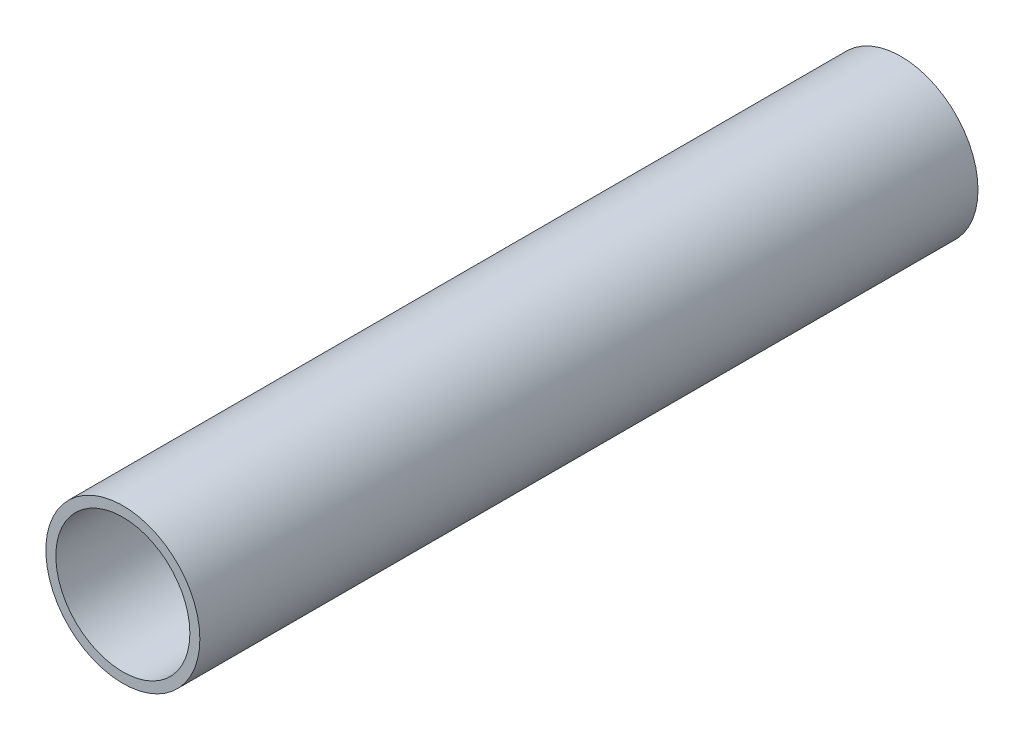
ISO-10303-21;
HEADER;
FILE_DESCRIPTION(('STEP AP214'),'2;1');
FILE_NAME('part.step','',(''),(''),'','','');
FILE_SCHEMA(('AUTOMOTIVE_DESIGN { 1 0 10303 214 1 1 1 1 }'));
ENDSEC;
DATA;
#1=APPLICATION_CONTEXT('core data for automotive mechanical design processes');
#2=APPLICATION_PROTOCOL_DEFINITION('international standard','automotive_design',2000,#1);
#3=PRODUCT_CONTEXT('',#1,'mechanical');
#4=PRODUCT('Part','Part','',(#3));
#5=PRODUCT_RELATED_PRODUCT_CATEGORY('part','',(#4));
#6=PRODUCT_DEFINITION_FORMATION('','',#4);
#7=PRODUCT_DEFINITION_CONTEXT('part definition',#1,'design');
#8=PRODUCT_DEFINITION('design','',#6,#7);
#9=PRODUCT_DEFINITION_SHAPE('','',#8);
#10=(LENGTH_UNIT() NAMED_UNIT(*) SI_UNIT(.MILLI.,.METRE.));
#11=(NAMED_UNIT(*) PLANE_ANGLE_UNIT() SI_UNIT($,.RADIAN.));
#12=(NAMED_UNIT(*) SI_UNIT($,.STERADIAN.) SOLID_ANGLE_UNIT());
#13=UNCERTAINTY_MEASURE_WITH_UNIT(LENGTH_MEASURE(1.E-05),#10,'distance_accuracy_value','');
#14=(GEOMETRIC_REPRESENTATION_CONTEXT(3) GLOBAL_UNCERTAINTY_ASSIGNED_CONTEXT((#13)) GLOBAL_UNIT_ASSIGNED_CONTEXT((#10,
#11,#12)) REPRESENTATION_CONTEXT('',''));
#15=CARTESIAN_POINT('',(0.,0.,0.));
#16=DIRECTION('',(0.,0.,1.));
#17=DIRECTION('',(1.,0.,0.));
#18=AXIS2_PLACEMENT_3D('',#15,#16,#17);
#19=CARTESIAN_POINT('',(0.,0.,304.8));
#20=DIRECTION('',(0.,0.,1.));
#21=DIRECTION('',(1.,0.,0.));
#22=AXIS2_PLACEMENT_3D('',#19,#20,#21);
#23=PLANE('',#22);
#24=CARTESIAN_POINT('',(0.,0.,304.8));
#25=DIRECTION('',(0.,0.,1.));
#26=DIRECTION('',(1.,0.,0.));
#27=AXIS2_PLACEMENT_3D('',#24,#25,#26);
#28=CIRCLE('',#27,30.1625);
#29=CARTESIAN_POINT('',(30.1625,0.,304.8));
#30=VERTEX_POINT('',#29);
#31=EDGE_CURVE('E11',#30,#30,#28,.T.);
#32=ORIENTED_EDGE('',*,*,#31,.T.);
#33=EDGE_LOOP('',(#32));
#34=FACE_BOUND('',#33,.T.);
#35=CARTESIAN_POINT('',(0.,0.,304.8));
#36=DIRECTION('',(0.,0.,1.));
#37=DIRECTION('',(1.,0.,0.));
#38=AXIS2_PLACEMENT_3D('',#35,#36,#37);
#39=CIRCLE('',#38,26.2509);
#40=CARTESIAN_POINT('',(26.2509,0.,304.8));
#41=VERTEX_POINT('',#40);
#42=EDGE_CURVE('E58',#41,#41,#39,.T.);
#43=ORIENTED_EDGE('',*,*,#42,.F.);
#44=EDGE_LOOP('',(#43));
#45=FACE_BOUND('',#44,.T.);
#46=ADVANCED_FACE('F47',(#34,#45),#23,.T.);
#47=CARTESIAN_POINT('',(0.,0.,0.));
#48=DIRECTION('',(0.,0.,1.));
#49=DIRECTION('',(1.,0.,0.));
#50=AXIS2_PLACEMENT_3D('',#47,#48,#49);
#51=PLANE('',#50);
#52=CARTESIAN_POINT('',(0.,0.,0.));
#53=DIRECTION('',(0.,0.,1.));
#54=DIRECTION('',(1.,0.,0.));
#55=AXIS2_PLACEMENT_3D('',#52,#53,#54);
#56=CIRCLE('',#55,30.1625);
#57=CARTESIAN_POINT('',(30.1625,0.,0.));
#58=VERTEX_POINT('',#57);
#59=EDGE_CURVE('E51',#58,#58,#56,.T.);
#60=ORIENTED_EDGE('',*,*,#59,.F.);
#61=EDGE_LOOP('',(#60));
#62=FACE_BOUND('',#61,.T.);
#63=CARTESIAN_POINT('',(0.,0.,0.));
#64=DIRECTION('',(0.,0.,1.));
#65=DIRECTION('',(1.,0.,0.));
#66=AXIS2_PLACEMENT_3D('',#63,#64,#65);
#67=CIRCLE('',#66,26.2509);
#68=CARTESIAN_POINT('',(26.2509,0.,0.));
#69=VERTEX_POINT('',#68);
#70=EDGE_CURVE('E60',#69,#69,#67,.T.);
#71=ORIENTED_EDGE('',*,*,#70,.T.);
#72=EDGE_LOOP('',(#71));
#73=FACE_BOUND('',#72,.T.);
#74=ADVANCED_FACE('F70',(#62,#73),#51,.F.);
#75=CARTESIAN_POINT('',(0.,0.,304.8));
#76=DIRECTION('',(0.,0.,-1.));
#77=DIRECTION('',(-1.,0.,0.));
#78=AXIS2_PLACEMENT_3D('',#75,#76,#77);
#79=CYLINDRICAL_SURFACE('',#78,30.1625);
#80=ORIENTED_EDGE('',*,*,#31,.F.);
#81=EDGE_LOOP('',(#80));
#82=FACE_BOUND('',#81,.T.);
#83=ORIENTED_EDGE('',*,*,#59,.T.);
#84=EDGE_LOOP('',(#83));
#85=FACE_BOUND('',#84,.T.);
#86=ADVANCED_FACE('F49',(#82,#85),#79,.T.);
#87=CARTESIAN_POINT('',(0.,0.,304.8));
#88=DIRECTION('',(0.,0.,-1.));
#89=DIRECTION('',(-1.,0.,0.));
#90=AXIS2_PLACEMENT_3D('',#87,#88,#89);
#91=CYLINDRICAL_SURFACE('',#90,26.2509);
#92=ORIENTED_EDGE('',*,*,#42,.T.);
#93=EDGE_LOOP('',(#92));
#94=FACE_BOUND('',#93,.T.);
#95=ORIENTED_EDGE('',*,*,#70,.F.);
#96=EDGE_LOOP('',(#95));
#97=FACE_BOUND('',#96,.T.);
#98=ADVANCED_FACE('F66',(#94,#97),#91,.F.);
#99=CLOSED_SHELL('',(#46,#74,#86,#98));
#100=MANIFOLD_SOLID_BREP('B2',#99);
#101=ADVANCED_BREP_SHAPE_REPRESENTATION('',(#18,#100),#14);
#102=SHAPE_DEFINITION_REPRESENTATION(#9,#101);
ENDSEC;
END-ISO-10303-21;
